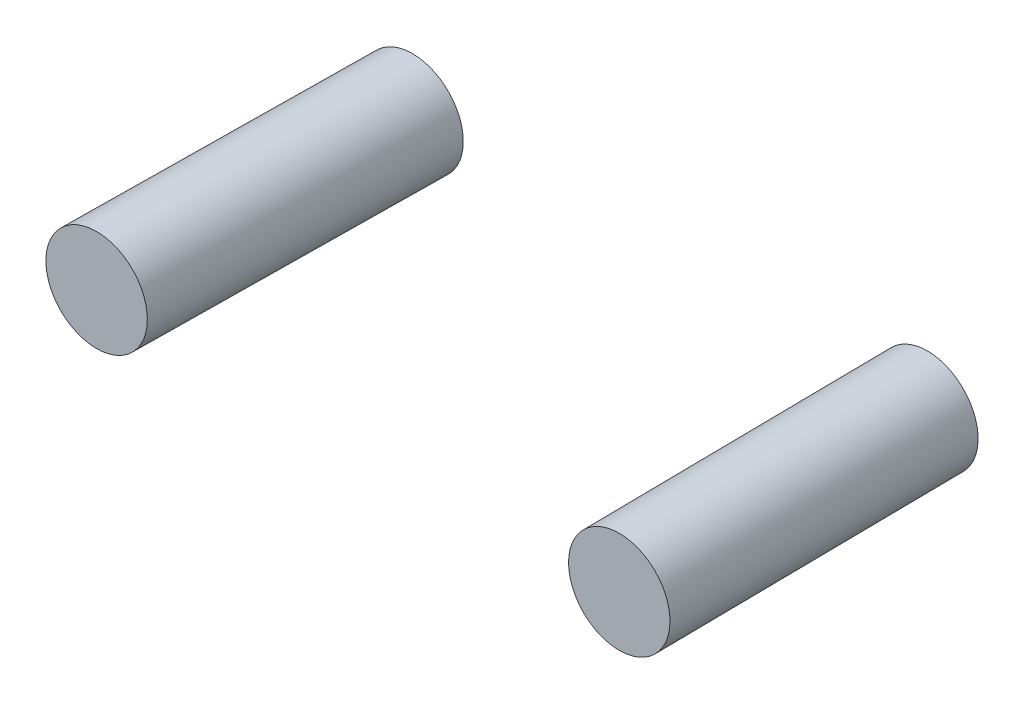
ISO-10303-21;
HEADER;
FILE_DESCRIPTION(('STEP AP214'),'2;1');
FILE_NAME('part.step','',(''),(''),'','','');
FILE_SCHEMA(('AUTOMOTIVE_DESIGN { 1 0 10303 214 1 1 1 1 }'));
ENDSEC;
DATA;
#1=APPLICATION_CONTEXT('core data for automotive mechanical design processes');
#2=APPLICATION_PROTOCOL_DEFINITION('international standard','automotive_design',2000,#1);
#3=PRODUCT_CONTEXT('',#1,'mechanical');
#4=PRODUCT('Part','Part','',(#3));
#5=PRODUCT_RELATED_PRODUCT_CATEGORY('part','',(#4));
#6=PRODUCT_DEFINITION_FORMATION('','',#4);
#7=PRODUCT_DEFINITION_CONTEXT('part definition',#1,'design');
#8=PRODUCT_DEFINITION('design','',#6,#7);
#9=PRODUCT_DEFINITION_SHAPE('','',#8);
#10=(LENGTH_UNIT() NAMED_UNIT(*) SI_UNIT(.MILLI.,.METRE.));
#11=(NAMED_UNIT(*) PLANE_ANGLE_UNIT() SI_UNIT($,.RADIAN.));
#12=(NAMED_UNIT(*) SI_UNIT($,.STERADIAN.) SOLID_ANGLE_UNIT());
#13=UNCERTAINTY_MEASURE_WITH_UNIT(LENGTH_MEASURE(1.E-05),#10,'distance_accuracy_value','');
#14=(GEOMETRIC_REPRESENTATION_CONTEXT(3) GLOBAL_UNCERTAINTY_ASSIGNED_CONTEXT((#13)) GLOBAL_UNIT_ASSIGNED_CONTEXT((#10,
#11,#12)) REPRESENTATION_CONTEXT('',''));
#15=CARTESIAN_POINT('',(0.,0.,0.));
#16=DIRECTION('',(0.,0.,1.));
#17=DIRECTION('',(1.,0.,0.));
#18=AXIS2_PLACEMENT_3D('',#15,#16,#17);
#19=CARTESIAN_POINT('',(83.82,0.,-101.6));
#20=DIRECTION('',(0.,0.,1.));
#21=DIRECTION('',(-1.,0.,0.));
#22=AXIS2_PLACEMENT_3D('',#19,#20,#21);
#23=PLANE('',#22);
#24=CARTESIAN_POINT('',(83.82,0.,-101.6));
#25=DIRECTION('',(0.,0.,-1.));
#26=DIRECTION('',(-1.,0.,0.));
#27=AXIS2_PLACEMENT_3D('',#24,#25,#26);
#28=CIRCLE('',#27,16.51);
#29=CARTESIAN_POINT('',(67.31,0.,-101.6));
#30=VERTEX_POINT('',#29);
#31=EDGE_CURVE('E55',#30,#30,#28,.T.);
#32=ORIENTED_EDGE('',*,*,#31,.T.);
#33=EDGE_LOOP('',(#32));
#34=FACE_BOUND('',#33,.T.);
#35=ADVANCED_FACE('F48',(#34),#23,.F.);
#36=CARTESIAN_POINT('',(85.09,0.,0.));
#37=DIRECTION('',(0.,0.,1.));
#38=DIRECTION('',(-1.,0.,0.));
#39=AXIS2_PLACEMENT_3D('',#36,#37,#38);
#40=PLANE('',#39);
#41=CARTESIAN_POINT('',(85.09,0.,0.));
#42=DIRECTION('',(0.,0.,-1.));
#43=DIRECTION('',(-1.,0.,0.));
#44=AXIS2_PLACEMENT_3D('',#41,#42,#43);
#45=CIRCLE('',#44,16.51);
#46=CARTESIAN_POINT('',(68.58,0.,0.));
#47=VERTEX_POINT('',#46);
#48=EDGE_CURVE('E11',#47,#47,#45,.T.);
#49=ORIENTED_EDGE('',*,*,#48,.F.);
#50=EDGE_LOOP('',(#49));
#51=FACE_BOUND('',#50,.T.);
#52=ADVANCED_FACE('F65',(#51),#40,.T.);
#53=CARTESIAN_POINT('',(67.31,0.,-101.6));
#54=CARTESIAN_POINT('',(68.58,0.,0.));
#55=CARTESIAN_POINT('',(67.31,33.02,-101.6));
#56=CARTESIAN_POINT('',(68.58,33.02,0.));
#57=CARTESIAN_POINT('',(100.33,33.02,-101.6));
#58=CARTESIAN_POINT('',(101.6,33.02,0.));
#59=CARTESIAN_POINT('',(100.33,0.,-101.6));
#60=CARTESIAN_POINT('',(101.6,0.,0.));
#61=CARTESIAN_POINT('',(100.33,-33.02,-101.6));
#62=CARTESIAN_POINT('',(101.6,-33.02,0.));
#63=CARTESIAN_POINT('',(67.31,-33.02,-101.6));
#64=CARTESIAN_POINT('',(68.58,-33.02,0.));
#65=CARTESIAN_POINT('',(67.31,0.,-101.6));
#66=CARTESIAN_POINT('',(68.58,0.,0.));
#67=(BOUNDED_SURFACE() B_SPLINE_SURFACE(3,1,((#53,#54),(#55,#56),(#57,#58),(#59,#60),(#61,#62),
(#63,#64),(#65,#66)),.UNSPECIFIED.,.T.,.F.,.F.) B_SPLINE_SURFACE_WITH_KNOTS((4,3,4),(2,2),(0.,
0.5,1.),(0.,1.),.UNSPECIFIED.) GEOMETRIC_REPRESENTATION_ITEM() RATIONAL_B_SPLINE_SURFACE(((1.,
1.),(0.333333333333333,0.333333333333333),(0.333333333333333,0.333333333333333),(1.,1.),
(0.333333333333333,0.333333333333333),(0.333333333333333,0.333333333333333),(1.,1.))) REPRESENTATION_ITEM('') SURFACE());
#68=CARTESIAN_POINT('',(68.58,0.,0.));
#69=CARTESIAN_POINT('',(68.5667708333334,0.,-1.05833333333332));
#70=CARTESIAN_POINT('',(68.5535416666667,0.,-2.11666666666665));
#71=CARTESIAN_POINT('',(68.5270833333333,0.,-4.23333333333332));
#72=CARTESIAN_POINT('',(68.5138541666667,0.,-5.29166666666665));
#73=CARTESIAN_POINT('',(68.4873958333333,0.,-7.40833333333332));
#74=CARTESIAN_POINT('',(68.4741666666667,0.,-8.46666666666665));
#75=CARTESIAN_POINT('',(68.4477083333333,0.,-10.5833333333333));
#76=CARTESIAN_POINT('',(68.4344791666667,0.,-11.6416666666667));
#77=CARTESIAN_POINT('',(68.4080208333333,0.,-13.7583333333333));
#78=CARTESIAN_POINT('',(68.3947916666667,0.,-14.8166666666667));
#79=CARTESIAN_POINT('',(68.3683333333333,0.,-16.9333333333333));
#80=CARTESIAN_POINT('',(68.3551041666667,0.,-17.9916666666666));
#81=CARTESIAN_POINT('',(68.3286458333333,0.,-20.1083333333333));
#82=CARTESIAN_POINT('',(68.3154166666667,0.,-21.1666666666667));
#83=CARTESIAN_POINT('',(68.2889583333333,0.,-23.2833333333333));
#84=CARTESIAN_POINT('',(68.2757291666667,0.,-24.3416666666667));
#85=CARTESIAN_POINT('',(68.2492708333333,0.,-26.4583333333333));
#86=CARTESIAN_POINT('',(68.2360416666667,0.,-27.5166666666666));
#87=CARTESIAN_POINT('',(68.2095833333333,0.,-29.6333333333333));
#88=CARTESIAN_POINT('',(68.1963541666667,0.,-30.6916666666666));
#89=CARTESIAN_POINT('',(68.1698958333333,0.,-32.8083333333333));
#90=CARTESIAN_POINT('',(68.1566666666667,0.,-33.8666666666666));
#91=CARTESIAN_POINT('',(68.1302083333333,0.,-35.9833333333333));
#92=CARTESIAN_POINT('',(68.1169791666667,0.,-37.0416666666666));
#93=CARTESIAN_POINT('',(68.0905208333333,0.,-39.1583333333333));
#94=CARTESIAN_POINT('',(68.0772916666667,0.,-40.2166666666666));
#95=CARTESIAN_POINT('',(68.0508333333333,0.,-42.3333333333333));
#96=CARTESIAN_POINT('',(68.0376041666667,0.,-43.3916666666666));
#97=CARTESIAN_POINT('',(68.0111458333333,0.,-45.5083333333333));
#98=CARTESIAN_POINT('',(67.9979166666667,0.,-46.5666666666666));
#99=CARTESIAN_POINT('',(67.9714583333333,0.,-48.6833333333333));
#100=CARTESIAN_POINT('',(67.9582291666667,0.,-49.7416666666666));
#101=CARTESIAN_POINT('',(67.9317708333333,0.,-51.8583333333333));
#102=CARTESIAN_POINT('',(67.9185416666667,0.,-52.9166666666666));
#103=CARTESIAN_POINT('',(67.8920833333333,0.,-55.0333333333333));
#104=CARTESIAN_POINT('',(67.8788541666667,0.,-56.0916666666666));
#105=CARTESIAN_POINT('',(67.8523958333333,0.,-58.2083333333333));
#106=CARTESIAN_POINT('',(67.8391666666667,0.,-59.2666666666666));
#107=CARTESIAN_POINT('',(67.8127083333333,0.,-61.3833333333333));
#108=CARTESIAN_POINT('',(67.7994791666667,0.,-62.4416666666666));
#109=CARTESIAN_POINT('',(67.7730208333333,0.,-64.5583333333333));
#110=CARTESIAN_POINT('',(67.7597916666667,0.,-65.6166666666666));
#111=CARTESIAN_POINT('',(67.7333333333333,0.,-67.7333333333333));
#112=CARTESIAN_POINT('',(67.7201041666667,0.,-68.7916666666667));
#113=CARTESIAN_POINT('',(67.6936458333333,0.,-70.9083333333333));
#114=CARTESIAN_POINT('',(67.6804166666667,0.,-71.9666666666667));
#115=CARTESIAN_POINT('',(67.6539583333333,0.,-74.0833333333333));
#116=CARTESIAN_POINT('',(67.6407291666667,0.,-75.1416666666667));
#117=CARTESIAN_POINT('',(67.6142708333333,0.,-77.2583333333333));
#118=CARTESIAN_POINT('',(67.6010416666667,0.,-78.3166666666666));
#119=CARTESIAN_POINT('',(67.5745833333333,0.,-80.4333333333333));
#120=CARTESIAN_POINT('',(67.5613541666667,0.,-81.4916666666666));
#121=CARTESIAN_POINT('',(67.5348958333333,0.,-83.6083333333333));
#122=CARTESIAN_POINT('',(67.5216666666667,0.,-84.6666666666666));
#123=CARTESIAN_POINT('',(67.4952083333333,0.,-86.7833333333333));
#124=CARTESIAN_POINT('',(67.4819791666667,0.,-87.8416666666666));
#125=CARTESIAN_POINT('',(67.4555208333333,0.,-89.9583333333333));
#126=CARTESIAN_POINT('',(67.4422916666667,0.,-91.0166666666667));
#127=CARTESIAN_POINT('',(67.4158333333333,0.,-93.1333333333333));
#128=CARTESIAN_POINT('',(67.4026041666667,0.,-94.1916666666666));
#129=CARTESIAN_POINT('',(67.3761458333333,0.,-96.3083333333333));
#130=CARTESIAN_POINT('',(67.3629166666667,0.,-97.3666666666666));
#131=CARTESIAN_POINT('',(67.3364583333333,0.,-99.4833333333333));
#132=CARTESIAN_POINT('',(67.3232291666666,0.,-100.541666666667));
#133=CARTESIAN_POINT('',(67.31,0.,-101.6));
#134=B_SPLINE_CURVE_WITH_KNOTS('',3,(#68,#69,#70,#71,#72,#73,#74,#75,#76,#77,#78,#79,#80,#81,
#82,#83,#84,#85,#86,#87,#88,#89,#90,#91,#92,#93,#94,#95,#96,#97,#98,#99,#100,#101,#102,#103,
#104,#105,#106,#107,#108,#109,#110,#111,#112,#113,#114,#115,#116,#117,#118,#119,#120,#121,#122,
#123,#124,#125,#126,#127,#128,#129,#130,#131,#132,#133),.UNSPECIFIED.,.F.,.F.,(4,2,2,2,2,2,2,2,
2,2,2,2,2,2,2,2,2,2,2,2,2,2,2,2,2,2,2,2,2,2,2,2,4),(0.,3.17524803718643,6.35049607437285,
9.52574411155928,12.7009921487457,15.8762401859321,19.0514882231186,22.226736260305,
25.4019842974914,28.5772323346778,31.7524803718643,34.9277284090507,38.1029764462371,
41.2782244834235,44.45347252061,47.6287205577964,50.8039685949828,53.9792166321692,
57.1544646693557,60.3297127065421,63.5049607437285,66.680208780915,69.8554568181014,
73.0307048552878,76.2059528924743,79.3812009296607,82.5564489668471,85.7316970040335,
88.90694504122,92.0821930784064,95.2574411155928,98.4326891527792,101.607937189966),.UNSPECIFIED.);
#135=EDGE_CURVE('',#47,#30,#134,.T.);
#136=ORIENTED_EDGE('',*,*,#48,.T.);
#137=ORIENTED_EDGE('',*,*,#31,.F.);
#138=ORIENTED_EDGE('',*,*,#135,.T.);
#139=ORIENTED_EDGE('',*,*,#135,.F.);
#140=EDGE_LOOP('',(#136,#138,#137,#139));
#141=FACE_BOUND('',#140,.T.);
#142=ADVANCED_FACE('F63',(#141),#67,.F.);
#143=CLOSED_SHELL('',(#35,#52,#142));
#144=MANIFOLD_SOLID_BREP('B2',#143);
#145=CARTESIAN_POINT('',(-83.82,0.,-101.6));
#146=DIRECTION('',(0.,0.,1.));
#147=DIRECTION('',(1.,0.,0.));
#148=AXIS2_PLACEMENT_3D('',#145,#146,#147);
#149=PLANE('',#148);
#150=CARTESIAN_POINT('',(-83.82,0.,-101.6));
#151=DIRECTION('',(0.,0.,1.));
#152=DIRECTION('',(1.,0.,0.));
#153=AXIS2_PLACEMENT_3D('',#150,#151,#152);
#154=CIRCLE('',#153,16.51);
#155=CARTESIAN_POINT('',(-67.31,0.,-101.6));
#156=VERTEX_POINT('',#155);
#157=EDGE_CURVE('E107',#156,#156,#154,.T.);
#158=ORIENTED_EDGE('',*,*,#157,.F.);
#159=EDGE_LOOP('',(#158));
#160=FACE_BOUND('',#159,.T.);
#161=ADVANCED_FACE('F100',(#160),#149,.F.);
#162=CARTESIAN_POINT('',(-85.09,0.,0.));
#163=DIRECTION('',(0.,0.,1.));
#164=DIRECTION('',(1.,0.,0.));
#165=AXIS2_PLACEMENT_3D('',#162,#163,#164);
#166=PLANE('',#165);
#167=CARTESIAN_POINT('',(-85.09,0.,0.));
#168=DIRECTION('',(0.,0.,1.));
#169=DIRECTION('',(1.,0.,0.));
#170=AXIS2_PLACEMENT_3D('',#167,#168,#169);
#171=CIRCLE('',#170,16.51);
#172=CARTESIAN_POINT('',(-68.58,0.,0.));
#173=VERTEX_POINT('',#172);
#174=EDGE_CURVE('E47',#173,#173,#171,.T.);
#175=ORIENTED_EDGE('',*,*,#174,.T.);
#176=EDGE_LOOP('',(#175));
#177=FACE_BOUND('',#176,.T.);
#178=ADVANCED_FACE('F117',(#177),#166,.T.);
#179=CARTESIAN_POINT('',(-67.31,0.,-101.6));
#180=CARTESIAN_POINT('',(-68.58,0.,0.));
#181=CARTESIAN_POINT('',(-67.31,33.02,-101.6));
#182=CARTESIAN_POINT('',(-68.58,33.02,0.));
#183=CARTESIAN_POINT('',(-100.33,33.02,-101.6));
#184=CARTESIAN_POINT('',(-101.6,33.02,0.));
#185=CARTESIAN_POINT('',(-100.33,0.,-101.6));
#186=CARTESIAN_POINT('',(-101.6,0.,0.));
#187=CARTESIAN_POINT('',(-100.33,-33.02,-101.6));
#188=CARTESIAN_POINT('',(-101.6,-33.02,0.));
#189=CARTESIAN_POINT('',(-67.31,-33.02,-101.6));
#190=CARTESIAN_POINT('',(-68.58,-33.02,0.));
#191=CARTESIAN_POINT('',(-67.31,0.,-101.6));
#192=CARTESIAN_POINT('',(-68.58,0.,0.));
#193=(BOUNDED_SURFACE() B_SPLINE_SURFACE(3,1,((#179,#180),(#181,#182),(#183,#184),(#185,#186),
(#187,#188),(#189,#190),(#191,#192)),.UNSPECIFIED.,.T.,.F.,.F.) B_SPLINE_SURFACE_WITH_KNOTS((4,
3,4),(2,2),(0.,0.5,1.),(0.,1.),
.UNSPECIFIED.) GEOMETRIC_REPRESENTATION_ITEM() RATIONAL_B_SPLINE_SURFACE(((1.,1.),
(0.333333333333333,0.333333333333333),(0.333333333333333,0.333333333333333),(1.,1.),
(0.333333333333333,0.333333333333333),(0.333333333333333,0.333333333333333),(1.,1.))) REPRESENTATION_ITEM('') SURFACE());
#194=CARTESIAN_POINT('',(-68.58,0.,0.));
#195=CARTESIAN_POINT('',(-68.5667708333334,0.,-1.05833333333332));
#196=CARTESIAN_POINT('',(-68.5535416666667,0.,-2.11666666666665));
#197=CARTESIAN_POINT('',(-68.5270833333333,0.,-4.23333333333332));
#198=CARTESIAN_POINT('',(-68.5138541666667,0.,-5.29166666666665));
#199=CARTESIAN_POINT('',(-68.4873958333333,0.,-7.40833333333332));
#200=CARTESIAN_POINT('',(-68.4741666666667,0.,-8.46666666666665));
#201=CARTESIAN_POINT('',(-68.4477083333333,0.,-10.5833333333333));
#202=CARTESIAN_POINT('',(-68.4344791666667,0.,-11.6416666666667));
#203=CARTESIAN_POINT('',(-68.4080208333333,0.,-13.7583333333333));
#204=CARTESIAN_POINT('',(-68.3947916666667,0.,-14.8166666666667));
#205=CARTESIAN_POINT('',(-68.3683333333333,0.,-16.9333333333333));
#206=CARTESIAN_POINT('',(-68.3551041666667,0.,-17.9916666666666));
#207=CARTESIAN_POINT('',(-68.3286458333333,0.,-20.1083333333333));
#208=CARTESIAN_POINT('',(-68.3154166666667,0.,-21.1666666666667));
#209=CARTESIAN_POINT('',(-68.2889583333333,0.,-23.2833333333333));
#210=CARTESIAN_POINT('',(-68.2757291666667,0.,-24.3416666666667));
#211=CARTESIAN_POINT('',(-68.2492708333333,0.,-26.4583333333333));
#212=CARTESIAN_POINT('',(-68.2360416666667,0.,-27.5166666666666));
#213=CARTESIAN_POINT('',(-68.2095833333333,0.,-29.6333333333333));
#214=CARTESIAN_POINT('',(-68.1963541666667,0.,-30.6916666666666));
#215=CARTESIAN_POINT('',(-68.1698958333333,0.,-32.8083333333333));
#216=CARTESIAN_POINT('',(-68.1566666666667,0.,-33.8666666666666));
#217=CARTESIAN_POINT('',(-68.1302083333333,0.,-35.9833333333333));
#218=CARTESIAN_POINT('',(-68.1169791666667,0.,-37.0416666666666));
#219=CARTESIAN_POINT('',(-68.0905208333333,0.,-39.1583333333333));
#220=CARTESIAN_POINT('',(-68.0772916666667,0.,-40.2166666666666));
#221=CARTESIAN_POINT('',(-68.0508333333333,0.,-42.3333333333333));
#222=CARTESIAN_POINT('',(-68.0376041666667,0.,-43.3916666666666));
#223=CARTESIAN_POINT('',(-68.0111458333333,0.,-45.5083333333333));
#224=CARTESIAN_POINT('',(-67.9979166666667,0.,-46.5666666666666));
#225=CARTESIAN_POINT('',(-67.9714583333333,0.,-48.6833333333333));
#226=CARTESIAN_POINT('',(-67.9582291666667,0.,-49.7416666666666));
#227=CARTESIAN_POINT('',(-67.9317708333333,0.,-51.8583333333333));
#228=CARTESIAN_POINT('',(-67.9185416666667,0.,-52.9166666666666));
#229=CARTESIAN_POINT('',(-67.8920833333333,0.,-55.0333333333333));
#230=CARTESIAN_POINT('',(-67.8788541666667,0.,-56.0916666666666));
#231=CARTESIAN_POINT('',(-67.8523958333333,0.,-58.2083333333333));
#232=CARTESIAN_POINT('',(-67.8391666666667,0.,-59.2666666666666));
#233=CARTESIAN_POINT('',(-67.8127083333333,0.,-61.3833333333333));
#234=CARTESIAN_POINT('',(-67.7994791666667,0.,-62.4416666666666));
#235=CARTESIAN_POINT('',(-67.7730208333333,0.,-64.5583333333333));
#236=CARTESIAN_POINT('',(-67.7597916666667,0.,-65.6166666666666));
#237=CARTESIAN_POINT('',(-67.7333333333333,0.,-67.7333333333333));
#238=CARTESIAN_POINT('',(-67.7201041666667,0.,-68.7916666666667));
#239=CARTESIAN_POINT('',(-67.6936458333333,0.,-70.9083333333333));
#240=CARTESIAN_POINT('',(-67.6804166666667,0.,-71.9666666666667));
#241=CARTESIAN_POINT('',(-67.6539583333333,0.,-74.0833333333333));
#242=CARTESIAN_POINT('',(-67.6407291666667,0.,-75.1416666666667));
#243=CARTESIAN_POINT('',(-67.6142708333333,0.,-77.2583333333333));
#244=CARTESIAN_POINT('',(-67.6010416666667,0.,-78.3166666666666));
#245=CARTESIAN_POINT('',(-67.5745833333333,0.,-80.4333333333333));
#246=CARTESIAN_POINT('',(-67.5613541666667,0.,-81.4916666666666));
#247=CARTESIAN_POINT('',(-67.5348958333333,0.,-83.6083333333333));
#248=CARTESIAN_POINT('',(-67.5216666666667,0.,-84.6666666666666));
#249=CARTESIAN_POINT('',(-67.4952083333333,0.,-86.7833333333333));
#250=CARTESIAN_POINT('',(-67.4819791666667,0.,-87.8416666666666));
#251=CARTESIAN_POINT('',(-67.4555208333333,0.,-89.9583333333333));
#252=CARTESIAN_POINT('',(-67.4422916666667,0.,-91.0166666666667));
#253=CARTESIAN_POINT('',(-67.4158333333333,0.,-93.1333333333333));
#254=CARTESIAN_POINT('',(-67.4026041666667,0.,-94.1916666666666));
#255=CARTESIAN_POINT('',(-67.3761458333333,0.,-96.3083333333333));
#256=CARTESIAN_POINT('',(-67.3629166666667,0.,-97.3666666666666));
#257=CARTESIAN_POINT('',(-67.3364583333333,0.,-99.4833333333333));
#258=CARTESIAN_POINT('',(-67.3232291666666,0.,-100.541666666667));
#259=CARTESIAN_POINT('',(-67.31,0.,-101.6));
#260=B_SPLINE_CURVE_WITH_KNOTS('',3,(#194,#195,#196,#197,#198,#199,#200,#201,#202,#203,#204,
#205,#206,#207,#208,#209,#210,#211,#212,#213,#214,#215,#216,#217,#218,#219,#220,#221,#222,#223,
#224,#225,#226,#227,#228,#229,#230,#231,#232,#233,#234,#235,#236,#237,#238,#239,#240,#241,#242,
#243,#244,#245,#246,#247,#248,#249,#250,#251,#252,#253,#254,#255,#256,#257,#258,#259),
.UNSPECIFIED.,.F.,.F.,(4,2,2,2,2,2,2,2,2,2,2,2,2,2,2,2,2,2,2,2,2,2,2,2,2,2,2,2,2,2,2,2,4),(0.,
3.17524803718643,6.35049607437285,9.52574411155928,12.7009921487457,15.8762401859321,
19.0514882231186,22.226736260305,25.4019842974914,28.5772323346778,31.7524803718643,
34.9277284090507,38.1029764462371,41.2782244834235,44.45347252061,47.6287205577964,
50.8039685949828,53.9792166321692,57.1544646693557,60.3297127065421,63.5049607437285,
66.680208780915,69.8554568181014,73.0307048552878,76.2059528924743,79.3812009296607,
82.5564489668471,85.7316970040335,88.90694504122,92.0821930784064,95.2574411155928,
98.4326891527792,101.607937189966),.UNSPECIFIED.);
#261=EDGE_CURVE('',#173,#156,#260,.T.);
#262=ORIENTED_EDGE('',*,*,#174,.F.);
#263=ORIENTED_EDGE('',*,*,#157,.T.);
#264=ORIENTED_EDGE('',*,*,#261,.T.);
#265=ORIENTED_EDGE('',*,*,#261,.F.);
#266=EDGE_LOOP('',(#262,#264,#263,#265));
#267=FACE_BOUND('',#266,.T.);
#268=ADVANCED_FACE('F114',(#267),#193,.T.);
#269=CLOSED_SHELL('',(#161,#178,#268));
#270=MANIFOLD_SOLID_BREP('B6',#269);
#271=ADVANCED_BREP_SHAPE_REPRESENTATION('',(#18,#144,#270),#14);
#272=SHAPE_DEFINITION_REPRESENTATION(#9,#271);
ENDSEC;
END-ISO-10303-21;
